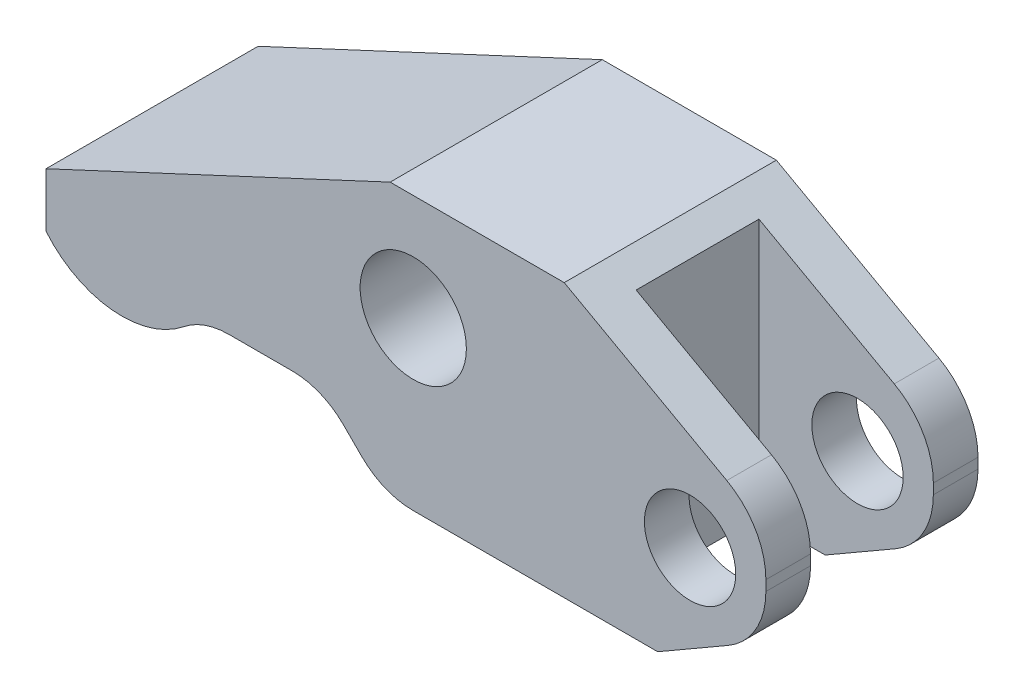
ISO-10303-21;
HEADER;
FILE_DESCRIPTION(('STEP AP214'),'2;1');
FILE_NAME('part.step','',(''),(''),'','','');
FILE_SCHEMA(('AUTOMOTIVE_DESIGN { 1 0 10303 214 1 1 1 1 }'));
ENDSEC;
DATA;
#1=APPLICATION_CONTEXT('core data for automotive mechanical design processes');
#2=APPLICATION_PROTOCOL_DEFINITION('international standard','automotive_design',2000,#1);
#3=PRODUCT_CONTEXT('',#1,'mechanical');
#4=PRODUCT('Part','Part','',(#3));
#5=PRODUCT_RELATED_PRODUCT_CATEGORY('part','',(#4));
#6=PRODUCT_DEFINITION_FORMATION('','',#4);
#7=PRODUCT_DEFINITION_CONTEXT('part definition',#1,'design');
#8=PRODUCT_DEFINITION('design','',#6,#7);
#9=PRODUCT_DEFINITION_SHAPE('','',#8);
#10=(LENGTH_UNIT() NAMED_UNIT(*) SI_UNIT(.MILLI.,.METRE.));
#11=(NAMED_UNIT(*) PLANE_ANGLE_UNIT() SI_UNIT($,.RADIAN.));
#12=(NAMED_UNIT(*) SI_UNIT($,.STERADIAN.) SOLID_ANGLE_UNIT());
#13=UNCERTAINTY_MEASURE_WITH_UNIT(LENGTH_MEASURE(1.E-05),#10,'distance_accuracy_value','');
#14=(GEOMETRIC_REPRESENTATION_CONTEXT(3) GLOBAL_UNCERTAINTY_ASSIGNED_CONTEXT((#13)) GLOBAL_UNIT_ASSIGNED_CONTEXT((#10,
#11,#12)) REPRESENTATION_CONTEXT('',''));
#15=CARTESIAN_POINT('',(0.,0.,0.));
#16=DIRECTION('',(0.,0.,1.));
#17=DIRECTION('',(1.,0.,0.));
#18=AXIS2_PLACEMENT_3D('',#15,#16,#17);
#19=CARTESIAN_POINT('',(23.749,9.0043,-6.9977));
#20=DIRECTION('',(-1.,0.,0.));
#21=DIRECTION('',(0.,0.,1.));
#22=AXIS2_PLACEMENT_3D('',#19,#20,#21);
#23=PLANE('',#22);
#24=DIRECTION('',(0.,0.,1.));
#25=VECTOR('',#24,1.);
#26=CARTESIAN_POINT('',(23.749,-1.9939,-6.9977));
#27=LINE('',#26,#25);
#28=CARTESIAN_POINT('',(23.749,-1.9939,4.0513));
#29=VERTEX_POINT('',#28);
#30=CARTESIAN_POINT('',(23.749,-1.9939,6.9977));
#31=VERTEX_POINT('',#30);
#32=EDGE_CURVE('E298',#29,#31,#27,.T.);
#33=ORIENTED_EDGE('',*,*,#32,.F.);
#34=DIRECTION('',(0.,1.,0.));
#35=VECTOR('',#34,1.);
#36=CARTESIAN_POINT('',(23.749,-9.0043,4.0513));
#37=LINE('',#36,#35);
#38=CARTESIAN_POINT('',(23.749,-1.31797931439956,4.0513));
#39=VERTEX_POINT('',#38);
#40=EDGE_CURVE('E210',#29,#39,#37,.T.);
#41=ORIENTED_EDGE('',*,*,#40,.T.);
#42=DIRECTION('',(0.,0.,1.));
#43=VECTOR('',#42,1.);
#44=CARTESIAN_POINT('',(23.749,-1.31797931439956,-6.9977));
#45=LINE('',#44,#43);
#46=CARTESIAN_POINT('',(23.749,-1.31797931439956,6.9977));
#47=VERTEX_POINT('',#46);
#48=EDGE_CURVE('E294',#39,#47,#45,.T.);
#49=ORIENTED_EDGE('',*,*,#48,.T.);
#50=DIRECTION('',(0.,-1.,0.));
#51=VECTOR('',#50,1.);
#52=CARTESIAN_POINT('',(23.749,9.0043,6.9977));
#53=LINE('',#52,#51);
#54=EDGE_CURVE('E332',#47,#31,#53,.T.);
#55=ORIENTED_EDGE('',*,*,#54,.T.);
#56=EDGE_LOOP('',(#33,#41,#49,#55));
#57=FACE_BOUND('',#56,.T.);
#58=ADVANCED_FACE('F35',(#57),#23,.F.);
#59=CARTESIAN_POINT('',(18.7452,-1.9939,-6.9977));
#60=DIRECTION('',(0.,0.,1.));
#61=DIRECTION('',(1.,0.,0.));
#62=AXIS2_PLACEMENT_3D('',#59,#60,#61);
#63=CYLINDRICAL_SURFACE('',#62,3.01244);
#64=CARTESIAN_POINT('',(18.7452,-1.9939,4.0513));
#65=DIRECTION('',(0.,0.,1.));
#66=DIRECTION('',(1.,0.,0.));
#67=AXIS2_PLACEMENT_3D('',#64,#65,#66);
#68=CIRCLE('',#67,3.01244);
#69=CARTESIAN_POINT('',(21.75764,-1.9939,4.0513));
#70=VERTEX_POINT('',#69);
#71=EDGE_CURVE('E229',#70,#70,#68,.F.);
#72=ORIENTED_EDGE('',*,*,#71,.T.);
#73=EDGE_LOOP('',(#72));
#74=FACE_BOUND('',#73,.T.);
#75=CARTESIAN_POINT('',(18.7452,-1.9939,6.9977));
#76=DIRECTION('',(0.,0.,1.));
#77=DIRECTION('',(1.,0.,0.));
#78=AXIS2_PLACEMENT_3D('',#75,#76,#77);
#79=CIRCLE('',#78,3.01244);
#80=CARTESIAN_POINT('',(21.75764,-1.9939,6.9977));
#81=VERTEX_POINT('',#80);
#82=EDGE_CURVE('E309',#81,#81,#79,.T.);
#83=ORIENTED_EDGE('',*,*,#82,.T.);
#84=EDGE_LOOP('',(#83));
#85=FACE_BOUND('',#84,.T.);
#86=ADVANCED_FACE('F461',(#74,#85),#63,.F.);
#87=CARTESIAN_POINT('',(16.6104310186192,-9.0043,-6.9977));
#88=DIRECTION('',(0.500000000000001,-0.866025403784438,0.));
#89=DIRECTION('',(0.866025403784438,0.500000000000001,0.));
#90=AXIS2_PLACEMENT_3D('',#87,#88,#89);
#91=PLANE('',#90);
#92=DIRECTION('',(-0.866025403784438,-0.500000000000001,0.));
#93=VECTOR('',#92,1.);
#94=CARTESIAN_POINT('',(16.6104310186192,-9.0043,4.0513));
#95=LINE('',#94,#93);
#96=CARTESIAN_POINT('',(21.2471,-6.32731791545657,4.0513));
#97=VERTEX_POINT('',#96);
#98=CARTESIAN_POINT('',(16.6104310186192,-9.0043,4.0513));
#99=VERTEX_POINT('',#98);
#100=EDGE_CURVE('E227',#97,#99,#95,.T.);
#101=ORIENTED_EDGE('',*,*,#100,.F.);
#102=DIRECTION('',(0.,0.,1.));
#103=VECTOR('',#102,1.);
#104=CARTESIAN_POINT('',(21.2471,-6.32731791545657,-6.9977));
#105=LINE('',#104,#103);
#106=CARTESIAN_POINT('',(21.2471,-6.32731791545657,6.9977));
#107=VERTEX_POINT('',#106);
#108=EDGE_CURVE('E302',#97,#107,#105,.T.);
#109=ORIENTED_EDGE('',*,*,#108,.T.);
#110=DIRECTION('',(0.866025403784438,0.500000000000001,0.));
#111=VECTOR('',#110,1.);
#112=CARTESIAN_POINT('',(16.6104310186192,-9.0043,6.9977));
#113=LINE('',#112,#111);
#114=CARTESIAN_POINT('',(16.6104310186191,-9.0043,6.9977));
#115=VERTEX_POINT('',#114);
#116=EDGE_CURVE('E251',#115,#107,#113,.T.);
#117=ORIENTED_EDGE('',*,*,#116,.F.);
#118=DIRECTION('',(0.,0.,1.));
#119=VECTOR('',#118,1.);
#120=CARTESIAN_POINT('',(16.6104310186192,-9.0043,-6.9977));
#121=LINE('',#120,#119);
#122=EDGE_CURVE('E278',#99,#115,#121,.T.);
#123=ORIENTED_EDGE('',*,*,#122,.F.);
#124=EDGE_LOOP('',(#101,#109,#117,#123));
#125=FACE_BOUND('',#124,.T.);
#126=ADVANCED_FACE('F391',(#125),#91,.T.);
#127=CARTESIAN_POINT('',(18.7452,-1.9939,-6.9977));
#128=DIRECTION('',(0.,0.,1.));
#129=DIRECTION('',(1.,0.,0.));
#130=AXIS2_PLACEMENT_3D('',#127,#128,#129);
#131=CYLINDRICAL_SURFACE('',#130,5.0038);
#132=CARTESIAN_POINT('',(18.7452,-1.9939,4.0513));
#133=DIRECTION('',(0.,0.,1.));
#134=DIRECTION('',(1.,0.,0.));
#135=AXIS2_PLACEMENT_3D('',#132,#133,#134);
#136=CIRCLE('',#135,5.0038);
#137=EDGE_CURVE('E225',#29,#97,#136,.F.);
#138=ORIENTED_EDGE('',*,*,#137,.F.);
#139=ORIENTED_EDGE('',*,*,#32,.T.);
#140=CARTESIAN_POINT('',(18.7452,-1.9939,6.9977));
#141=DIRECTION('',(0.,0.,1.));
#142=DIRECTION('',(-1.,0.,0.));
#143=AXIS2_PLACEMENT_3D('',#140,#141,#142);
#144=CIRCLE('',#143,5.0038);
#145=EDGE_CURVE('E254',#107,#31,#144,.T.);
#146=ORIENTED_EDGE('',*,*,#145,.F.);
#147=ORIENTED_EDGE('',*,*,#108,.F.);
#148=EDGE_LOOP('',(#138,#139,#146,#147));
#149=FACE_BOUND('',#148,.T.);
#150=ADVANCED_FACE('F387',(#149),#131,.T.);
#151=CARTESIAN_POINT('',(18.7452,-1.31797931439956,-6.9977));
#152=DIRECTION('',(0.,0.,1.));
#153=DIRECTION('',(1.,0.,0.));
#154=AXIS2_PLACEMENT_3D('',#151,#152,#153);
#155=CYLINDRICAL_SURFACE('',#154,5.0038);
#156=CARTESIAN_POINT('',(18.7452,-1.31797931439956,4.0513));
#157=DIRECTION('',(0.,0.,1.));
#158=DIRECTION('',(1.,0.,0.));
#159=AXIS2_PLACEMENT_3D('',#156,#157,#158);
#160=CIRCLE('',#159,5.0038);
#161=CARTESIAN_POINT('',(21.1710903777886,3.05844277618454,4.0513));
#162=VERTEX_POINT('',#161);
#163=EDGE_CURVE('E43',#162,#39,#160,.F.);
#164=ORIENTED_EDGE('',*,*,#163,.F.);
#165=DIRECTION('',(0.,0.,1.));
#166=VECTOR('',#165,1.);
#167=CARTESIAN_POINT('',(21.1710903777886,3.05844277618454,-6.9977));
#168=LINE('',#167,#166);
#169=CARTESIAN_POINT('',(21.1710903777886,3.05844277618454,6.9977));
#170=VERTEX_POINT('',#169);
#171=EDGE_CURVE('E290',#162,#170,#168,.T.);
#172=ORIENTED_EDGE('',*,*,#171,.T.);
#173=CARTESIAN_POINT('',(18.7452,-1.31797931439956,6.9977));
#174=DIRECTION('',(0.,0.,1.));
#175=DIRECTION('',(1.,0.,0.));
#176=AXIS2_PLACEMENT_3D('',#173,#174,#175);
#177=CIRCLE('',#176,5.0038);
#178=EDGE_CURVE('E257',#47,#170,#177,.T.);
#179=ORIENTED_EDGE('',*,*,#178,.F.);
#180=ORIENTED_EDGE('',*,*,#48,.F.);
#181=EDGE_LOOP('',(#164,#172,#179,#180));
#182=FACE_BOUND('',#181,.T.);
#183=ADVANCED_FACE('F377',(#182),#155,.T.);
#184=CARTESIAN_POINT('',(-23.749,9.0043,-6.9977));
#185=DIRECTION('',(1.,0.,0.));
#186=DIRECTION('',(0.,0.,-1.));
#187=AXIS2_PLACEMENT_3D('',#184,#185,#186);
#188=PLANE('',#187);
#189=DIRECTION('',(0.,-1.,0.));
#190=VECTOR('',#189,1.);
#191=CARTESIAN_POINT('',(-23.749,9.0043,-6.9977));
#192=LINE('',#191,#190);
#193=CARTESIAN_POINT('',(-23.749,-1.58442777832049,-6.9977));
#194=VERTEX_POINT('',#193);
#195=CARTESIAN_POINT('',(-23.749,-5.15579218181083,-6.9977));
#196=VERTEX_POINT('',#195);
#197=EDGE_CURVE('E323',#194,#196,#192,.T.);
#198=ORIENTED_EDGE('',*,*,#197,.T.);
#199=DIRECTION('',(0.,0.,1.));
#200=VECTOR('',#199,1.);
#201=CARTESIAN_POINT('',(-23.749,-5.15579218181083,-6.9977));
#202=LINE('',#201,#200);
#203=CARTESIAN_POINT('',(-23.749,-5.15579218181083,6.9977));
#204=VERTEX_POINT('',#203);
#205=EDGE_CURVE('E248',#196,#204,#202,.T.);
#206=ORIENTED_EDGE('',*,*,#205,.T.);
#207=DIRECTION('',(0.,-1.,0.));
#208=VECTOR('',#207,1.);
#209=CARTESIAN_POINT('',(-23.749,9.0043,6.9977));
#210=LINE('',#209,#208);
#211=CARTESIAN_POINT('',(-23.749,-1.58442777832049,6.9977));
#212=VERTEX_POINT('',#211);
#213=EDGE_CURVE('E335',#212,#204,#210,.T.);
#214=ORIENTED_EDGE('',*,*,#213,.F.);
#215=DIRECTION('',(0.,0.,1.));
#216=VECTOR('',#215,1.);
#217=CARTESIAN_POINT('',(-23.749,-1.58442777832049,-6.9977));
#218=LINE('',#217,#216);
#219=EDGE_CURVE('E279',#194,#212,#218,.T.);
#220=ORIENTED_EDGE('',*,*,#219,.F.);
#221=EDGE_LOOP('',(#198,#206,#214,#220));
#222=FACE_BOUND('',#221,.T.);
#223=ADVANCED_FACE('F424',(#222),#188,.F.);
#224=CARTESIAN_POINT('',(-23.749,9.0043,6.9977));
#225=DIRECTION('',(0.,0.,-1.));
#226=DIRECTION('',(-1.,0.,0.));
#227=AXIS2_PLACEMENT_3D('',#224,#225,#226);
#228=PLANE('',#227);
#229=ORIENTED_EDGE('',*,*,#82,.F.);
#230=EDGE_LOOP('',(#229));
#231=FACE_BOUND('',#230,.T.);
#232=CARTESIAN_POINT('',(0.482600000000003,1.9939,6.9977));
#233=DIRECTION('',(0.,0.,1.));
#234=DIRECTION('',(1.,0.,0.));
#235=AXIS2_PLACEMENT_3D('',#232,#233,#234);
#236=CIRCLE('',#235,3.5052);
#237=CARTESIAN_POINT('',(3.9878,1.9939,6.9977));
#238=VERTEX_POINT('',#237);
#239=EDGE_CURVE('E281',#238,#238,#236,.T.);
#240=ORIENTED_EDGE('',*,*,#239,.F.);
#241=EDGE_LOOP('',(#240));
#242=FACE_BOUND('',#241,.T.);
#243=DIRECTION('',(-0.707106781186551,0.707106781186544,0.));
#244=VECTOR('',#243,1.);
#245=CARTESIAN_POINT('',(-1.52399999999995,-9.0043,6.9977));
#246=LINE('',#245,#244);
#247=CARTESIAN_POINT('',(-2.92262369847795,-7.60567630152202,6.9977));
#248=VERTEX_POINT('',#247);
#249=CARTESIAN_POINT('',(-4.113176301522,-6.41512369847798,6.9977));
#250=VERTEX_POINT('',#249);
#251=EDGE_CURVE('E237',#248,#250,#246,.T.);
#252=ORIENTED_EDGE('',*,*,#251,.F.);
#253=CARTESIAN_POINT('',(0.453952603044033,-4.2291,6.9977));
#254=DIRECTION('',(0.,0.,-1.));
#255=DIRECTION('',(-1.,0.,0.));
#256=AXIS2_PLACEMENT_3D('',#253,#254,#255);
#257=CIRCLE('',#256,4.7752);
#258=CARTESIAN_POINT('',(0.453952603044025,-9.0043,6.9977));
#259=VERTEX_POINT('',#258);
#260=EDGE_CURVE('E351',#248,#259,#257,.F.);
#261=ORIENTED_EDGE('',*,*,#260,.T.);
#262=DIRECTION('',(1.,0.,0.));
#263=VECTOR('',#262,1.);
#264=CARTESIAN_POINT('',(-23.749,-9.0043,6.9977));
#265=LINE('',#264,#263);
#266=EDGE_CURVE('E315',#259,#115,#265,.T.);
#267=ORIENTED_EDGE('',*,*,#266,.T.);
#268=ORIENTED_EDGE('',*,*,#116,.T.);
#269=ORIENTED_EDGE('',*,*,#145,.T.);
#270=ORIENTED_EDGE('',*,*,#54,.F.);
#271=ORIENTED_EDGE('',*,*,#178,.T.);
#272=DIRECTION('',(-0.874619707139395,0.484809620246338,0.));
#273=VECTOR('',#272,1.);
#274=CARTESIAN_POINT('',(21.1710903777886,3.05844277618454,6.9977));
#275=LINE('',#274,#273);
#276=CARTESIAN_POINT('',(10.44448,9.0043,6.9977));
#277=VERTEX_POINT('',#276);
#278=EDGE_CURVE('E260',#170,#277,#275,.T.);
#279=ORIENTED_EDGE('',*,*,#278,.T.);
#280=DIRECTION('',(1.,0.,0.));
#281=VECTOR('',#280,1.);
#282=CARTESIAN_POINT('',(-23.749,9.0043,6.9977));
#283=LINE('',#282,#281);
#284=CARTESIAN_POINT('',(-1.0414,9.0043,6.9977));
#285=VERTEX_POINT('',#284);
#286=EDGE_CURVE('E316',#285,#277,#283,.T.);
#287=ORIENTED_EDGE('',*,*,#286,.F.);
#288=DIRECTION('',(-0.906307787036649,-0.422618261740701,0.));
#289=VECTOR('',#288,1.);
#290=CARTESIAN_POINT('',(-1.0414,9.0043,6.9977));
#291=LINE('',#290,#289);
#292=EDGE_CURVE('E263',#285,#212,#291,.T.);
#293=ORIENTED_EDGE('',*,*,#292,.T.);
#294=ORIENTED_EDGE('',*,*,#213,.T.);
#295=CARTESIAN_POINT('',(-18.7452,-1.0033,6.9977));
#296=DIRECTION('',(0.,0.,-1.));
#297=DIRECTION('',(1.,0.,0.));
#298=AXIS2_PLACEMENT_3D('',#295,#296,#297);
#299=CIRCLE('',#298,6.5024);
#300=CARTESIAN_POINT('',(-14.6702968108146,-6.07048558558559,6.9977));
#301=VERTEX_POINT('',#300);
#302=EDGE_CURVE('E235',#301,#204,#299,.T.);
#303=ORIENTED_EDGE('',*,*,#302,.F.);
#304=CARTESIAN_POINT('',(-11.6777897812565,-9.7917,6.9977));
#305=DIRECTION('',(0.,0.,-1.));
#306=DIRECTION('',(-1.,0.,0.));
#307=AXIS2_PLACEMENT_3D('',#304,#305,#306);
#308=CIRCLE('',#307,4.7752);
#309=CARTESIAN_POINT('',(-11.6777897812565,-5.0165,6.9977));
#310=VERTEX_POINT('',#309);
#311=EDGE_CURVE('E356',#301,#310,#308,.T.);
#312=ORIENTED_EDGE('',*,*,#311,.T.);
#313=DIRECTION('',(-1.,0.,0.));
#314=VECTOR('',#313,1.);
#315=CARTESIAN_POINT('',(-5.5118,-5.0165,6.9977));
#316=LINE('',#315,#314);
#317=CARTESIAN_POINT('',(-7.48975260304399,-5.0165,6.9977));
#318=VERTEX_POINT('',#317);
#319=EDGE_CURVE('E232',#318,#310,#316,.T.);
#320=ORIENTED_EDGE('',*,*,#319,.F.);
#321=CARTESIAN_POINT('',(-7.48975260304398,-9.7917,6.9977));
#322=DIRECTION('',(0.,0.,-1.));
#323=DIRECTION('',(-1.,0.,0.));
#324=AXIS2_PLACEMENT_3D('',#321,#322,#323);
#325=CIRCLE('',#324,4.7752);
#326=EDGE_CURVE('E360',#318,#250,#325,.T.);
#327=ORIENTED_EDGE('',*,*,#326,.T.);
#328=EDGE_LOOP('',(#252,#261,#267,#268,#269,#270,#271,#279,#287,#293,#294,#303,#312,#320,#327));
#329=FACE_BOUND('',#328,.T.);
#330=ADVANCED_FACE('F382',(#231,#242,#329),#228,.F.);
#331=CARTESIAN_POINT('',(23.749,-1.31797931439956,-6.9977));
#332=VERTEX_POINT('',#331);
#333=CARTESIAN_POINT('',(23.749,-1.31797931439956,-4.0513));
#334=VERTEX_POINT('',#333);
#335=EDGE_CURVE('E291',#332,#334,#45,.T.);
#336=ORIENTED_EDGE('',*,*,#335,.T.);
#337=DIRECTION('',(0.,1.,0.));
#338=VECTOR('',#337,1.);
#339=CARTESIAN_POINT('',(23.749,-9.0043,-4.0513));
#340=LINE('',#339,#338);
#341=CARTESIAN_POINT('',(23.749,-1.9939,-4.0513));
#342=VERTEX_POINT('',#341);
#343=EDGE_CURVE('E50',#342,#334,#340,.T.);
#344=ORIENTED_EDGE('',*,*,#343,.F.);
#345=CARTESIAN_POINT('',(23.749,-1.9939,-6.9977));
#346=VERTEX_POINT('',#345);
#347=EDGE_CURVE('E295',#346,#342,#27,.T.);
#348=ORIENTED_EDGE('',*,*,#347,.F.);
#349=DIRECTION('',(0.,-1.,0.));
#350=VECTOR('',#349,1.);
#351=CARTESIAN_POINT('',(23.749,9.0043,-6.9977));
#352=LINE('',#351,#350);
#353=EDGE_CURVE('E329',#332,#346,#352,.T.);
#354=ORIENTED_EDGE('',*,*,#353,.F.);
#355=EDGE_LOOP('',(#336,#344,#348,#354));
#356=FACE_BOUND('',#355,.T.);
#357=ADVANCED_FACE('F440',(#356),#23,.F.);
#358=CARTESIAN_POINT('',(-23.749,9.0043,-6.9977));
#359=DIRECTION('',(0.,0.,1.));
#360=DIRECTION('',(1.,0.,0.));
#361=AXIS2_PLACEMENT_3D('',#358,#359,#360);
#362=PLANE('',#361);
#363=CARTESIAN_POINT('',(18.7452,-1.9939,-6.9977));
#364=DIRECTION('',(0.,0.,1.));
#365=DIRECTION('',(1.,0.,0.));
#366=AXIS2_PLACEMENT_3D('',#363,#364,#365);
#367=CIRCLE('',#366,3.01244);
#368=CARTESIAN_POINT('',(21.75764,-1.9939,-6.9977));
#369=VERTEX_POINT('',#368);
#370=EDGE_CURVE('E312',#369,#369,#367,.T.);
#371=ORIENTED_EDGE('',*,*,#370,.T.);
#372=EDGE_LOOP('',(#371));
#373=FACE_BOUND('',#372,.T.);
#374=CARTESIAN_POINT('',(0.482600000000003,1.9939,-6.9977));
#375=DIRECTION('',(0.,0.,1.));
#376=DIRECTION('',(1.,0.,0.));
#377=AXIS2_PLACEMENT_3D('',#374,#375,#376);
#378=CIRCLE('',#377,3.5052);
#379=CARTESIAN_POINT('',(3.9878,1.9939,-6.9977));
#380=VERTEX_POINT('',#379);
#381=EDGE_CURVE('E306',#380,#380,#378,.T.);
#382=ORIENTED_EDGE('',*,*,#381,.T.);
#383=EDGE_LOOP('',(#382));
#384=FACE_BOUND('',#383,.T.);
#385=DIRECTION('',(-1.,0.,0.));
#386=VECTOR('',#385,1.);
#387=CARTESIAN_POINT('',(-23.749,-9.0043,-6.9977));
#388=LINE('',#387,#386);
#389=CARTESIAN_POINT('',(16.6104310186192,-9.0043,-6.9977));
#390=VERTEX_POINT('',#389);
#391=CARTESIAN_POINT('',(0.453952603044025,-9.0043,-6.9977));
#392=VERTEX_POINT('',#391);
#393=EDGE_CURVE('E320',#390,#392,#388,.T.);
#394=ORIENTED_EDGE('',*,*,#393,.T.);
#395=CARTESIAN_POINT('',(0.453952603044033,-4.2291,-6.9977));
#396=DIRECTION('',(0.,0.,1.));
#397=DIRECTION('',(1.,0.,0.));
#398=AXIS2_PLACEMENT_3D('',#395,#396,#397);
#399=CIRCLE('',#398,4.7752);
#400=CARTESIAN_POINT('',(-2.92262369847795,-7.60567630152202,-6.9977));
#401=VERTEX_POINT('',#400);
#402=EDGE_CURVE('E354',#392,#401,#399,.F.);
#403=ORIENTED_EDGE('',*,*,#402,.T.);
#404=DIRECTION('',(-0.707106781186551,0.707106781186544,0.));
#405=VECTOR('',#404,1.);
#406=CARTESIAN_POINT('',(-1.52399999999995,-9.0043,-6.9977));
#407=LINE('',#406,#405);
#408=CARTESIAN_POINT('',(-4.113176301522,-6.41512369847798,-6.9977));
#409=VERTEX_POINT('',#408);
#410=EDGE_CURVE('E245',#401,#409,#407,.T.);
#411=ORIENTED_EDGE('',*,*,#410,.T.);
#412=CARTESIAN_POINT('',(-7.48975260304398,-9.7917,-6.9977));
#413=DIRECTION('',(0.,0.,1.));
#414=DIRECTION('',(1.,0.,0.));
#415=AXIS2_PLACEMENT_3D('',#412,#413,#414);
#416=CIRCLE('',#415,4.7752);
#417=CARTESIAN_POINT('',(-7.48975260304399,-5.0165,-6.9977));
#418=VERTEX_POINT('',#417);
#419=EDGE_CURVE('E362',#409,#418,#416,.T.);
#420=ORIENTED_EDGE('',*,*,#419,.T.);
#421=DIRECTION('',(-1.,0.,0.));
#422=VECTOR('',#421,1.);
#423=CARTESIAN_POINT('',(-5.5118,-5.0165,-6.9977));
#424=LINE('',#423,#422);
#425=CARTESIAN_POINT('',(-11.6777897812565,-5.0165,-6.9977));
#426=VERTEX_POINT('',#425);
#427=EDGE_CURVE('E240',#418,#426,#424,.T.);
#428=ORIENTED_EDGE('',*,*,#427,.T.);
#429=CARTESIAN_POINT('',(-11.6777897812565,-9.7917,-6.9977));
#430=DIRECTION('',(0.,0.,1.));
#431=DIRECTION('',(1.,0.,0.));
#432=AXIS2_PLACEMENT_3D('',#429,#430,#431);
#433=CIRCLE('',#432,4.7752);
#434=CARTESIAN_POINT('',(-14.6702968108146,-6.07048558558559,-6.9977));
#435=VERTEX_POINT('',#434);
#436=EDGE_CURVE('E358',#426,#435,#433,.T.);
#437=ORIENTED_EDGE('',*,*,#436,.T.);
#438=CARTESIAN_POINT('',(-18.7452,-1.0033,-6.9977));
#439=DIRECTION('',(0.,0.,-1.));
#440=DIRECTION('',(1.,0.,0.));
#441=AXIS2_PLACEMENT_3D('',#438,#439,#440);
#442=CIRCLE('',#441,6.5024);
#443=EDGE_CURVE('E243',#435,#196,#442,.T.);
#444=ORIENTED_EDGE('',*,*,#443,.T.);
#445=ORIENTED_EDGE('',*,*,#197,.F.);
#446=DIRECTION('',(-0.906307787036649,-0.422618261740701,0.));
#447=VECTOR('',#446,1.);
#448=CARTESIAN_POINT('',(-1.0414,9.0043,-6.9977));
#449=LINE('',#448,#447);
#450=CARTESIAN_POINT('',(-1.0414,9.0043,-6.9977));
#451=VERTEX_POINT('',#450);
#452=EDGE_CURVE('E276',#451,#194,#449,.T.);
#453=ORIENTED_EDGE('',*,*,#452,.F.);
#454=DIRECTION('',(-1.,0.,0.));
#455=VECTOR('',#454,1.);
#456=CARTESIAN_POINT('',(-23.749,9.0043,-6.9977));
#457=LINE('',#456,#455);
#458=CARTESIAN_POINT('',(10.44448,9.0043,-6.9977));
#459=VERTEX_POINT('',#458);
#460=EDGE_CURVE('E319',#459,#451,#457,.T.);
#461=ORIENTED_EDGE('',*,*,#460,.F.);
#462=DIRECTION('',(-0.874619707139395,0.484809620246338,0.));
#463=VECTOR('',#462,1.);
#464=CARTESIAN_POINT('',(21.1710903777886,3.05844277618454,-6.9977));
#465=LINE('',#464,#463);
#466=CARTESIAN_POINT('',(21.1710903777886,3.05844277618454,-6.9977));
#467=VERTEX_POINT('',#466);
#468=EDGE_CURVE('E274',#467,#459,#465,.T.);
#469=ORIENTED_EDGE('',*,*,#468,.F.);
#470=CARTESIAN_POINT('',(18.7452,-1.31797931439956,-6.9977));
#471=DIRECTION('',(0.,0.,1.));
#472=DIRECTION('',(1.,0.,0.));
#473=AXIS2_PLACEMENT_3D('',#470,#471,#472);
#474=CIRCLE('',#473,5.0038);
#475=EDGE_CURVE('E271',#332,#467,#474,.T.);
#476=ORIENTED_EDGE('',*,*,#475,.F.);
#477=ORIENTED_EDGE('',*,*,#353,.T.);
#478=CARTESIAN_POINT('',(18.7452,-1.9939,-6.9977));
#479=DIRECTION('',(0.,0.,1.));
#480=DIRECTION('',(-1.,0.,0.));
#481=AXIS2_PLACEMENT_3D('',#478,#479,#480);
#482=CIRCLE('',#481,5.0038);
#483=CARTESIAN_POINT('',(21.2471,-6.32731791545657,-6.9977));
#484=VERTEX_POINT('',#483);
#485=EDGE_CURVE('E269',#484,#346,#482,.T.);
#486=ORIENTED_EDGE('',*,*,#485,.F.);
#487=DIRECTION('',(0.866025403784438,0.500000000000001,0.));
#488=VECTOR('',#487,1.);
#489=CARTESIAN_POINT('',(16.6104310186192,-9.0043,-6.9977));
#490=LINE('',#489,#488);
#491=EDGE_CURVE('E266',#390,#484,#490,.T.);
#492=ORIENTED_EDGE('',*,*,#491,.F.);
#493=EDGE_LOOP('',(#394,#403,#411,#420,#428,#437,#444,#445,#453,#461,#469,#476,#477,#486,#492));
#494=FACE_BOUND('',#493,.T.);
#495=ADVANCED_FACE('F401',(#373,#384,#494),#362,.F.);
#496=CARTESIAN_POINT('',(0.,9.0043,0.));
#497=DIRECTION('',(0.,1.,0.));
#498=DIRECTION('',(0.,0.,1.));
#499=AXIS2_PLACEMENT_3D('',#496,#497,#498);
#500=PLANE('',#499);
#501=ORIENTED_EDGE('',*,*,#460,.T.);
#502=DIRECTION('',(0.,0.,1.));
#503=VECTOR('',#502,1.);
#504=CARTESIAN_POINT('',(-1.0414,9.0043,-6.9977));
#505=LINE('',#504,#503);
#506=EDGE_CURVE('E282',#451,#285,#505,.T.);
#507=ORIENTED_EDGE('',*,*,#506,.T.);
#508=ORIENTED_EDGE('',*,*,#286,.T.);
#509=DIRECTION('',(0.,0.,1.));
#510=VECTOR('',#509,1.);
#511=CARTESIAN_POINT('',(10.44448,9.0043,-6.9977));
#512=LINE('',#511,#510);
#513=EDGE_CURVE('E285',#459,#277,#512,.T.);
#514=ORIENTED_EDGE('',*,*,#513,.F.);
#515=EDGE_LOOP('',(#501,#507,#508,#514));
#516=FACE_BOUND('',#515,.T.);
#517=ADVANCED_FACE('F431',(#516),#500,.T.);
#518=CARTESIAN_POINT('',(0.,-9.0043,0.));
#519=DIRECTION('',(0.,1.,0.));
#520=DIRECTION('',(0.,0.,1.));
#521=AXIS2_PLACEMENT_3D('',#518,#519,#520);
#522=PLANE('',#521);
#523=DIRECTION('',(0.,0.,1.));
#524=VECTOR('',#523,1.);
#525=CARTESIAN_POINT('',(12.2428,-9.0043,-4.0513));
#526=LINE('',#525,#524);
#527=CARTESIAN_POINT('',(12.2428,-9.0043,-4.0513));
#528=VERTEX_POINT('',#527);
#529=CARTESIAN_POINT('',(12.2428,-9.0043,4.0513));
#530=VERTEX_POINT('',#529);
#531=EDGE_CURVE('E197',#528,#530,#526,.T.);
#532=ORIENTED_EDGE('',*,*,#531,.T.);
#533=DIRECTION('',(1.,0.,0.));
#534=VECTOR('',#533,1.);
#535=CARTESIAN_POINT('',(23.749,-9.0043,4.0513));
#536=LINE('',#535,#534);
#537=EDGE_CURVE('E202',#530,#99,#536,.T.);
#538=ORIENTED_EDGE('',*,*,#537,.T.);
#539=ORIENTED_EDGE('',*,*,#122,.T.);
#540=ORIENTED_EDGE('',*,*,#266,.F.);
#541=DIRECTION('',(0.,0.,1.));
#542=VECTOR('',#541,1.);
#543=CARTESIAN_POINT('',(0.453952603044033,-9.0043,0.));
#544=LINE('',#543,#542);
#545=EDGE_CURVE('E58',#259,#392,#544,.F.);
#546=ORIENTED_EDGE('',*,*,#545,.T.);
#547=ORIENTED_EDGE('',*,*,#393,.F.);
#548=CARTESIAN_POINT('',(16.6104310186192,-9.0043,-4.0513));
#549=VERTEX_POINT('',#548);
#550=EDGE_CURVE('E206',#390,#549,#121,.T.);
#551=ORIENTED_EDGE('',*,*,#550,.T.);
#552=DIRECTION('',(-1.,0.,0.));
#553=VECTOR('',#552,1.);
#554=CARTESIAN_POINT('',(23.749,-9.0043,-4.0513));
#555=LINE('',#554,#553);
#556=EDGE_CURVE('E188',#549,#528,#555,.T.);
#557=ORIENTED_EDGE('',*,*,#556,.T.);
#558=EDGE_LOOP('',(#532,#538,#539,#540,#546,#547,#551,#557));
#559=FACE_BOUND('',#558,.T.);
#560=ADVANCED_FACE('F205',(#559),#522,.F.);
#561=CARTESIAN_POINT('',(18.7452,-1.9939,-4.0513));
#562=DIRECTION('',(0.,0.,-1.));
#563=DIRECTION('',(-1.,0.,0.));
#564=AXIS2_PLACEMENT_3D('',#561,#562,#563);
#565=CIRCLE('',#564,3.01244);
#566=CARTESIAN_POINT('',(15.73276,-1.9939,-4.0513));
#567=VERTEX_POINT('',#566);
#568=EDGE_CURVE('E220',#567,#567,#565,.F.);
#569=ORIENTED_EDGE('',*,*,#568,.T.);
#570=EDGE_LOOP('',(#569));
#571=FACE_BOUND('',#570,.T.);
#572=ORIENTED_EDGE('',*,*,#370,.F.);
#573=EDGE_LOOP('',(#572));
#574=FACE_BOUND('',#573,.T.);
#575=ADVANCED_FACE('F457',(#571,#574),#63,.F.);
#576=CARTESIAN_POINT('',(0.482600000000003,1.9939,-6.9977));
#577=DIRECTION('',(0.,0.,1.));
#578=DIRECTION('',(1.,0.,0.));
#579=AXIS2_PLACEMENT_3D('',#576,#577,#578);
#580=CYLINDRICAL_SURFACE('',#579,3.5052);
#581=ORIENTED_EDGE('',*,*,#381,.F.);
#582=EDGE_LOOP('',(#581));
#583=FACE_BOUND('',#582,.T.);
#584=ORIENTED_EDGE('',*,*,#239,.T.);
#585=EDGE_LOOP('',(#584));
#586=FACE_BOUND('',#585,.T.);
#587=ADVANCED_FACE('F450',(#583,#586),#580,.F.);
#588=DIRECTION('',(0.866025403784438,0.500000000000001,0.));
#589=VECTOR('',#588,1.);
#590=CARTESIAN_POINT('',(16.6104310186192,-9.0043,-4.0513));
#591=LINE('',#590,#589);
#592=CARTESIAN_POINT('',(21.2471,-6.32731791545657,-4.0513));
#593=VERTEX_POINT('',#592);
#594=EDGE_CURVE('E218',#549,#593,#591,.T.);
#595=ORIENTED_EDGE('',*,*,#594,.F.);
#596=ORIENTED_EDGE('',*,*,#550,.F.);
#597=ORIENTED_EDGE('',*,*,#491,.T.);
#598=EDGE_CURVE('E299',#484,#593,#105,.T.);
#599=ORIENTED_EDGE('',*,*,#598,.T.);
#600=EDGE_LOOP('',(#595,#596,#597,#599));
#601=FACE_BOUND('',#600,.T.);
#602=ADVANCED_FACE('F448',(#601),#91,.T.);
#603=CARTESIAN_POINT('',(18.7452,-1.9939,-4.0513));
#604=DIRECTION('',(0.,0.,-1.));
#605=DIRECTION('',(-1.,0.,0.));
#606=AXIS2_PLACEMENT_3D('',#603,#604,#605);
#607=CIRCLE('',#606,5.0038);
#608=EDGE_CURVE('E216',#593,#342,#607,.F.);
#609=ORIENTED_EDGE('',*,*,#608,.F.);
#610=ORIENTED_EDGE('',*,*,#598,.F.);
#611=ORIENTED_EDGE('',*,*,#485,.T.);
#612=ORIENTED_EDGE('',*,*,#347,.T.);
#613=EDGE_LOOP('',(#609,#610,#611,#612));
#614=FACE_BOUND('',#613,.T.);
#615=ADVANCED_FACE('F446',(#614),#131,.T.);
#616=CARTESIAN_POINT('',(21.1710903777886,3.05844277618454,-6.9977));
#617=DIRECTION('',(0.484809620246338,0.874619707139395,0.));
#618=DIRECTION('',(-0.874619707139395,0.484809620246338,0.));
#619=AXIS2_PLACEMENT_3D('',#616,#617,#618);
#620=PLANE('',#619);
#621=DIRECTION('',(0.874619707139395,-0.484809620246338,0.));
#622=VECTOR('',#621,1.);
#623=CARTESIAN_POINT('',(21.1710903777886,3.05844277618454,4.0513));
#624=LINE('',#623,#622);
#625=CARTESIAN_POINT('',(12.2428,8.00747494659145,4.0513));
#626=VERTEX_POINT('',#625);
#627=EDGE_CURVE('E223',#626,#162,#624,.T.);
#628=ORIENTED_EDGE('',*,*,#627,.F.);
#629=DIRECTION('',(0.,0.,1.));
#630=VECTOR('',#629,1.);
#631=CARTESIAN_POINT('',(12.2428,8.00747494659145,-6.9977));
#632=LINE('',#631,#630);
#633=CARTESIAN_POINT('',(12.2428,8.00747494659145,-4.0513));
#634=VERTEX_POINT('',#633);
#635=EDGE_CURVE('E12',#634,#626,#632,.T.);
#636=ORIENTED_EDGE('',*,*,#635,.F.);
#637=DIRECTION('',(-0.874619707139395,0.484809620246338,0.));
#638=VECTOR('',#637,1.);
#639=CARTESIAN_POINT('',(21.1710903777886,3.05844277618454,-4.0513));
#640=LINE('',#639,#638);
#641=CARTESIAN_POINT('',(21.1710903777886,3.05844277618454,-4.0513));
#642=VERTEX_POINT('',#641);
#643=EDGE_CURVE('E191',#642,#634,#640,.T.);
#644=ORIENTED_EDGE('',*,*,#643,.F.);
#645=EDGE_CURVE('E287',#467,#642,#168,.T.);
#646=ORIENTED_EDGE('',*,*,#645,.F.);
#647=ORIENTED_EDGE('',*,*,#468,.T.);
#648=ORIENTED_EDGE('',*,*,#513,.T.);
#649=ORIENTED_EDGE('',*,*,#278,.F.);
#650=ORIENTED_EDGE('',*,*,#171,.F.);
#651=EDGE_LOOP('',(#628,#636,#644,#646,#647,#648,#649,#650));
#652=FACE_BOUND('',#651,.T.);
#653=ADVANCED_FACE('F436',(#652),#620,.T.);
#654=CARTESIAN_POINT('',(18.7452,-1.31797931439956,-4.0513));
#655=DIRECTION('',(0.,0.,-1.));
#656=DIRECTION('',(-1.,0.,0.));
#657=AXIS2_PLACEMENT_3D('',#654,#655,#656);
#658=CIRCLE('',#657,5.0038);
#659=EDGE_CURVE('E364',#334,#642,#658,.F.);
#660=ORIENTED_EDGE('',*,*,#659,.F.);
#661=ORIENTED_EDGE('',*,*,#335,.F.);
#662=ORIENTED_EDGE('',*,*,#475,.T.);
#663=ORIENTED_EDGE('',*,*,#645,.T.);
#664=EDGE_LOOP('',(#660,#661,#662,#663));
#665=FACE_BOUND('',#664,.T.);
#666=ADVANCED_FACE('F438',(#665),#155,.T.);
#667=CARTESIAN_POINT('',(-1.0414,9.0043,-6.9977));
#668=DIRECTION('',(-0.422618261740701,0.906307787036649,0.));
#669=DIRECTION('',(-0.906307787036649,-0.422618261740701,0.));
#670=AXIS2_PLACEMENT_3D('',#667,#668,#669);
#671=PLANE('',#670);
#672=ORIENTED_EDGE('',*,*,#506,.F.);
#673=ORIENTED_EDGE('',*,*,#452,.T.);
#674=ORIENTED_EDGE('',*,*,#219,.T.);
#675=ORIENTED_EDGE('',*,*,#292,.F.);
#676=EDGE_LOOP('',(#672,#673,#674,#675));
#677=FACE_BOUND('',#676,.T.);
#678=ADVANCED_FACE('F427',(#677),#671,.T.);
#679=CARTESIAN_POINT('',(-5.5118,-5.0165,-6.9977));
#680=DIRECTION('',(0.,1.,0.));
#681=DIRECTION('',(-1.,0.,0.));
#682=AXIS2_PLACEMENT_3D('',#679,#680,#681);
#683=PLANE('',#682);
#684=ORIENTED_EDGE('',*,*,#319,.T.);
#685=DIRECTION('',(0.,0.,-1.));
#686=VECTOR('',#685,1.);
#687=CARTESIAN_POINT('',(-11.6777897812565,-5.0165,-6.9977));
#688=LINE('',#687,#686);
#689=EDGE_CURVE('E344',#310,#426,#688,.T.);
#690=ORIENTED_EDGE('',*,*,#689,.T.);
#691=ORIENTED_EDGE('',*,*,#427,.F.);
#692=DIRECTION('',(0.,0.,1.));
#693=VECTOR('',#692,1.);
#694=CARTESIAN_POINT('',(-7.48975260304399,-5.0165,6.9977));
#695=LINE('',#694,#693);
#696=EDGE_CURVE('E341',#418,#318,#695,.T.);
#697=ORIENTED_EDGE('',*,*,#696,.T.);
#698=EDGE_LOOP('',(#684,#690,#691,#697));
#699=FACE_BOUND('',#698,.T.);
#700=ADVANCED_FACE('F408',(#699),#683,.F.);
#701=CARTESIAN_POINT('',(-1.52399999999995,-9.0043,-6.9977));
#702=DIRECTION('',(0.707106781186544,0.707106781186551,0.));
#703=DIRECTION('',(-0.707106781186551,0.707106781186544,0.));
#704=AXIS2_PLACEMENT_3D('',#701,#702,#703);
#705=PLANE('',#704);
#706=ORIENTED_EDGE('',*,*,#251,.T.);
#707=DIRECTION('',(0.,0.,1.));
#708=VECTOR('',#707,1.);
#709=CARTESIAN_POINT('',(-4.113176301522,-6.41512369847798,-6.9977));
#710=LINE('',#709,#708);
#711=EDGE_CURVE('E349',#250,#409,#710,.F.);
#712=ORIENTED_EDGE('',*,*,#711,.T.);
#713=ORIENTED_EDGE('',*,*,#410,.F.);
#714=DIRECTION('',(0.,0.,1.));
#715=VECTOR('',#714,1.);
#716=CARTESIAN_POINT('',(-2.92262369847795,-7.60567630152202,-6.9977));
#717=LINE('',#716,#715);
#718=EDGE_CURVE('E346',#401,#248,#717,.T.);
#719=ORIENTED_EDGE('',*,*,#718,.T.);
#720=EDGE_LOOP('',(#706,#712,#713,#719));
#721=FACE_BOUND('',#720,.T.);
#722=ADVANCED_FACE('F397',(#721),#705,.F.);
#723=CARTESIAN_POINT('',(-18.7452,-1.0033,-6.9977));
#724=DIRECTION('',(0.,0.,1.));
#725=DIRECTION('',(1.,0.,0.));
#726=AXIS2_PLACEMENT_3D('',#723,#724,#725);
#727=CYLINDRICAL_SURFACE('',#726,6.5024);
#728=ORIENTED_EDGE('',*,*,#443,.F.);
#729=DIRECTION('',(0.,0.,1.));
#730=VECTOR('',#729,1.);
#731=CARTESIAN_POINT('',(-14.6702968108146,-6.07048558558559,-6.9977));
#732=LINE('',#731,#730);
#733=EDGE_CURVE('E338',#435,#301,#732,.T.);
#734=ORIENTED_EDGE('',*,*,#733,.T.);
#735=ORIENTED_EDGE('',*,*,#302,.T.);
#736=ORIENTED_EDGE('',*,*,#205,.F.);
#737=EDGE_LOOP('',(#728,#734,#735,#736));
#738=FACE_BOUND('',#737,.T.);
#739=ADVANCED_FACE('F417',(#738),#727,.T.);
#740=CARTESIAN_POINT('',(-11.6777897812565,-9.7917,-6.9977));
#741=DIRECTION('',(0.,0.,1.));
#742=DIRECTION('',(1.,0.,0.));
#743=AXIS2_PLACEMENT_3D('',#740,#741,#742);
#744=CYLINDRICAL_SURFACE('',#743,4.7752);
#745=ORIENTED_EDGE('',*,*,#436,.F.);
#746=ORIENTED_EDGE('',*,*,#689,.F.);
#747=ORIENTED_EDGE('',*,*,#311,.F.);
#748=ORIENTED_EDGE('',*,*,#733,.F.);
#749=EDGE_LOOP('',(#745,#746,#747,#748));
#750=FACE_BOUND('',#749,.T.);
#751=ADVANCED_FACE('F414',(#750),#744,.F.);
#752=CARTESIAN_POINT('',(-7.48975260304398,-9.7917,-6.9977));
#753=DIRECTION('',(0.,0.,-1.));
#754=DIRECTION('',(-1.,0.,0.));
#755=AXIS2_PLACEMENT_3D('',#752,#753,#754);
#756=CYLINDRICAL_SURFACE('',#755,4.7752);
#757=ORIENTED_EDGE('',*,*,#419,.F.);
#758=ORIENTED_EDGE('',*,*,#711,.F.);
#759=ORIENTED_EDGE('',*,*,#326,.F.);
#760=ORIENTED_EDGE('',*,*,#696,.F.);
#761=EDGE_LOOP('',(#757,#758,#759,#760));
#762=FACE_BOUND('',#761,.T.);
#763=ADVANCED_FACE('F405',(#762),#756,.F.);
#764=CARTESIAN_POINT('',(0.453952603044033,-4.2291,-6.9977));
#765=DIRECTION('',(0.,0.,1.));
#766=DIRECTION('',(1.,0.,0.));
#767=AXIS2_PLACEMENT_3D('',#764,#765,#766);
#768=CYLINDRICAL_SURFACE('',#767,4.7752);
#769=ORIENTED_EDGE('',*,*,#402,.F.);
#770=ORIENTED_EDGE('',*,*,#545,.F.);
#771=ORIENTED_EDGE('',*,*,#260,.F.);
#772=ORIENTED_EDGE('',*,*,#718,.F.);
#773=EDGE_LOOP('',(#769,#770,#771,#772));
#774=FACE_BOUND('',#773,.T.);
#775=ADVANCED_FACE('F37',(#774),#768,.T.);
#776=CARTESIAN_POINT('',(23.749,-9.0043,4.0513));
#777=DIRECTION('',(0.,0.,1.));
#778=DIRECTION('',(1.,0.,0.));
#779=AXIS2_PLACEMENT_3D('',#776,#777,#778);
#780=PLANE('',#779);
#781=ORIENTED_EDGE('',*,*,#100,.T.);
#782=ORIENTED_EDGE('',*,*,#537,.F.);
#783=DIRECTION('',(0.,1.,0.));
#784=VECTOR('',#783,1.);
#785=CARTESIAN_POINT('',(12.2428,-9.0043,4.0513));
#786=LINE('',#785,#784);
#787=EDGE_CURVE('E194',#530,#626,#786,.T.);
#788=ORIENTED_EDGE('',*,*,#787,.T.);
#789=ORIENTED_EDGE('',*,*,#627,.T.);
#790=ORIENTED_EDGE('',*,*,#163,.T.);
#791=ORIENTED_EDGE('',*,*,#40,.F.);
#792=ORIENTED_EDGE('',*,*,#137,.T.);
#793=EDGE_LOOP('',(#781,#782,#788,#789,#790,#791,#792));
#794=FACE_BOUND('',#793,.T.);
#795=ORIENTED_EDGE('',*,*,#71,.F.);
#796=EDGE_LOOP('',(#795));
#797=FACE_BOUND('',#796,.T.);
#798=ADVANCED_FACE('F367',(#794,#797),#780,.F.);
#799=CARTESIAN_POINT('',(23.749,-9.0043,-4.0513));
#800=DIRECTION('',(0.,0.,-1.));
#801=DIRECTION('',(-1.,0.,0.));
#802=AXIS2_PLACEMENT_3D('',#799,#800,#801);
#803=PLANE('',#802);
#804=ORIENTED_EDGE('',*,*,#594,.T.);
#805=ORIENTED_EDGE('',*,*,#608,.T.);
#806=ORIENTED_EDGE('',*,*,#343,.T.);
#807=ORIENTED_EDGE('',*,*,#659,.T.);
#808=ORIENTED_EDGE('',*,*,#643,.T.);
#809=DIRECTION('',(0.,1.,0.));
#810=VECTOR('',#809,1.);
#811=CARTESIAN_POINT('',(12.2428,-9.0043,-4.0513));
#812=LINE('',#811,#810);
#813=EDGE_CURVE('E183',#528,#634,#812,.T.);
#814=ORIENTED_EDGE('',*,*,#813,.F.);
#815=ORIENTED_EDGE('',*,*,#556,.F.);
#816=EDGE_LOOP('',(#804,#805,#806,#807,#808,#814,#815));
#817=FACE_BOUND('',#816,.T.);
#818=ORIENTED_EDGE('',*,*,#568,.F.);
#819=EDGE_LOOP('',(#818));
#820=FACE_BOUND('',#819,.T.);
#821=ADVANCED_FACE('F185',(#817,#820),#803,.F.);
#822=CARTESIAN_POINT('',(12.2428,-9.0043,-4.0513));
#823=DIRECTION('',(-1.,0.,0.));
#824=DIRECTION('',(0.,0.,1.));
#825=AXIS2_PLACEMENT_3D('',#822,#823,#824);
#826=PLANE('',#825);
#827=ORIENTED_EDGE('',*,*,#635,.T.);
#828=ORIENTED_EDGE('',*,*,#787,.F.);
#829=ORIENTED_EDGE('',*,*,#531,.F.);
#830=ORIENTED_EDGE('',*,*,#813,.T.);
#831=EDGE_LOOP('',(#827,#828,#829,#830));
#832=FACE_BOUND('',#831,.T.);
#833=ADVANCED_FACE('F198',(#832),#826,.F.);
#834=CLOSED_SHELL('',(#58,#86,#126,#150,#183,#223,#330,#357,#495,#517,#560,#575,#587,#602,#615,
#653,#666,#678,#700,#722,#739,#751,#763,#775,#798,#821,#833));
#835=MANIFOLD_SOLID_BREP('B2',#834);
#836=ADVANCED_BREP_SHAPE_REPRESENTATION('',(#18,#835),#14);
#837=SHAPE_DEFINITION_REPRESENTATION(#9,#836);
ENDSEC;
END-ISO-10303-21;
